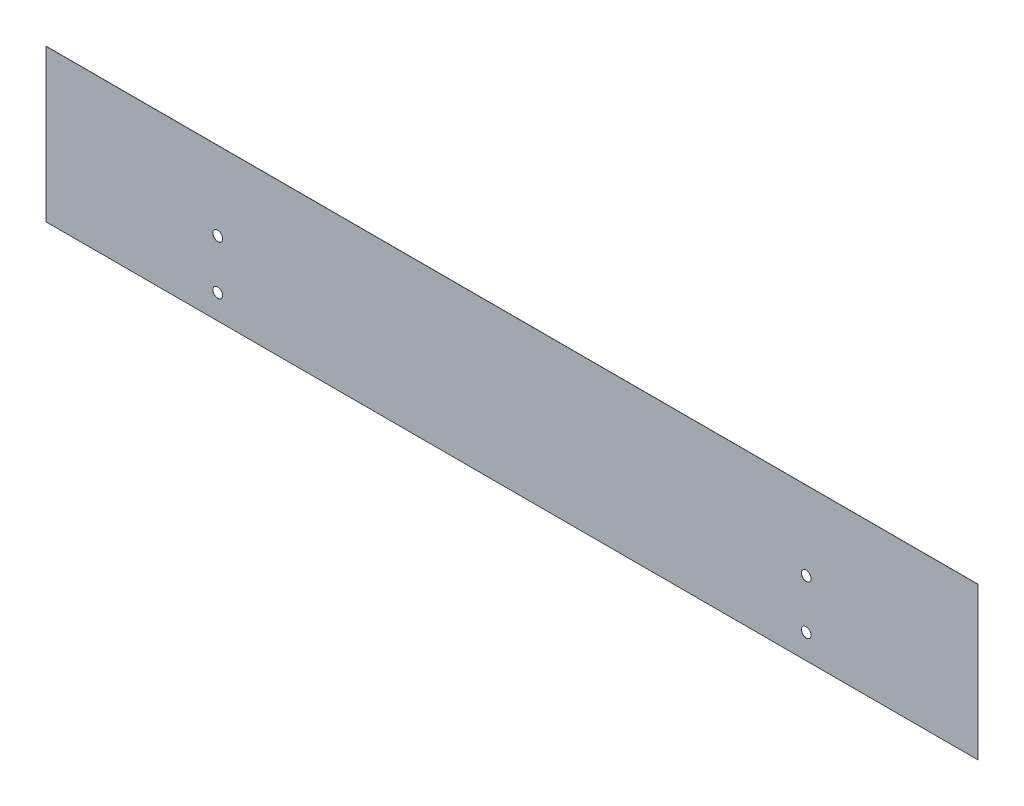
ISO-10303-21;
HEADER;
FILE_DESCRIPTION(('STEP AP214'),'2;1');
FILE_NAME('part.step','',(''),(''),'','','');
FILE_SCHEMA(('AUTOMOTIVE_DESIGN { 1 0 10303 214 1 1 1 1 }'));
ENDSEC;
DATA;
#1=APPLICATION_CONTEXT('core data for automotive mechanical design processes');
#2=APPLICATION_PROTOCOL_DEFINITION('international standard','automotive_design',2000,#1);
#3=PRODUCT_CONTEXT('',#1,'mechanical');
#4=PRODUCT('Part','Part','',(#3));
#5=PRODUCT_RELATED_PRODUCT_CATEGORY('part','',(#4));
#6=PRODUCT_DEFINITION_FORMATION('','',#4);
#7=PRODUCT_DEFINITION_CONTEXT('part definition',#1,'design');
#8=PRODUCT_DEFINITION('design','',#6,#7);
#9=PRODUCT_DEFINITION_SHAPE('','',#8);
#10=(LENGTH_UNIT() NAMED_UNIT(*) SI_UNIT(.MILLI.,.METRE.));
#11=(NAMED_UNIT(*) PLANE_ANGLE_UNIT() SI_UNIT($,.RADIAN.));
#12=(NAMED_UNIT(*) SI_UNIT($,.STERADIAN.) SOLID_ANGLE_UNIT());
#13=UNCERTAINTY_MEASURE_WITH_UNIT(LENGTH_MEASURE(1.E-05),#10,'distance_accuracy_value','');
#14=(GEOMETRIC_REPRESENTATION_CONTEXT(3) GLOBAL_UNCERTAINTY_ASSIGNED_CONTEXT((#13)) GLOBAL_UNIT_ASSIGNED_CONTEXT((#10,
#11,#12)) REPRESENTATION_CONTEXT('',''));
#15=CARTESIAN_POINT('',(0.,0.,0.));
#16=DIRECTION('',(0.,0.,1.));
#17=DIRECTION('',(1.,0.,0.));
#18=AXIS2_PLACEMENT_3D('',#15,#16,#17);
#19=CARTESIAN_POINT('',(190.,-31.,0.0625));
#20=DIRECTION('',(-1.,0.,0.));
#21=DIRECTION('',(0.,0.,1.));
#22=AXIS2_PLACEMENT_3D('',#19,#20,#21);
#23=PLANE('',#22);
#24=DIRECTION('',(0.,1.,0.));
#25=VECTOR('',#24,1.);
#26=CARTESIAN_POINT('',(190.,-31.,0.));
#27=LINE('',#26,#25);
#28=CARTESIAN_POINT('',(190.,-31.,0.));
#29=VERTEX_POINT('',#28);
#30=CARTESIAN_POINT('',(190.,31.,0.));
#31=VERTEX_POINT('',#30);
#32=EDGE_CURVE('E96',#29,#31,#27,.T.);
#33=ORIENTED_EDGE('',*,*,#32,.T.);
#34=DIRECTION('',(0.,0.,-1.));
#35=VECTOR('',#34,1.);
#36=CARTESIAN_POINT('',(190.,31.,0.0625));
#37=LINE('',#36,#35);
#38=CARTESIAN_POINT('',(190.,31.,0.0625));
#39=VERTEX_POINT('',#38);
#40=EDGE_CURVE('E11',#39,#31,#37,.T.);
#41=ORIENTED_EDGE('',*,*,#40,.F.);
#42=DIRECTION('',(0.,1.,0.));
#43=VECTOR('',#42,1.);
#44=CARTESIAN_POINT('',(190.,-31.,0.0625));
#45=LINE('',#44,#43);
#46=CARTESIAN_POINT('',(190.,-31.,0.0625));
#47=VERTEX_POINT('',#46);
#48=EDGE_CURVE('E84',#47,#39,#45,.T.);
#49=ORIENTED_EDGE('',*,*,#48,.F.);
#50=DIRECTION('',(0.,0.,-1.));
#51=VECTOR('',#50,1.);
#52=CARTESIAN_POINT('',(190.,-31.,0.0625));
#53=LINE('',#52,#51);
#54=EDGE_CURVE('E92',#47,#29,#53,.T.);
#55=ORIENTED_EDGE('',*,*,#54,.T.);
#56=EDGE_LOOP('',(#33,#41,#49,#55));
#57=FACE_BOUND('',#56,.T.);
#58=ADVANCED_FACE('F33',(#57),#23,.F.);
#59=CARTESIAN_POINT('',(-190.,31.,0.0625));
#60=DIRECTION('',(0.,-1.,0.));
#61=DIRECTION('',(0.,0.,-1.));
#62=AXIS2_PLACEMENT_3D('',#59,#60,#61);
#63=PLANE('',#62);
#64=DIRECTION('',(-1.,0.,0.));
#65=VECTOR('',#64,1.);
#66=CARTESIAN_POINT('',(-190.,31.,0.));
#67=LINE('',#66,#65);
#68=CARTESIAN_POINT('',(-190.,31.,0.));
#69=VERTEX_POINT('',#68);
#70=EDGE_CURVE('E88',#31,#69,#67,.T.);
#71=ORIENTED_EDGE('',*,*,#70,.T.);
#72=DIRECTION('',(0.,0.,-1.));
#73=VECTOR('',#72,1.);
#74=CARTESIAN_POINT('',(-190.,31.,0.0625));
#75=LINE('',#74,#73);
#76=CARTESIAN_POINT('',(-190.,31.,0.0625));
#77=VERTEX_POINT('',#76);
#78=EDGE_CURVE('E41',#77,#69,#75,.T.);
#79=ORIENTED_EDGE('',*,*,#78,.F.);
#80=DIRECTION('',(-1.,0.,0.));
#81=VECTOR('',#80,1.);
#82=CARTESIAN_POINT('',(-190.,31.,0.0625));
#83=LINE('',#82,#81);
#84=EDGE_CURVE('E79',#39,#77,#83,.T.);
#85=ORIENTED_EDGE('',*,*,#84,.F.);
#86=ORIENTED_EDGE('',*,*,#40,.T.);
#87=EDGE_LOOP('',(#71,#79,#85,#86));
#88=FACE_BOUND('',#87,.T.);
#89=ADVANCED_FACE('F87',(#88),#63,.F.);
#90=CARTESIAN_POINT('',(-190.,-31.,0.0625));
#91=DIRECTION('',(1.,0.,0.));
#92=DIRECTION('',(0.,0.,-1.));
#93=AXIS2_PLACEMENT_3D('',#90,#91,#92);
#94=PLANE('',#93);
#95=DIRECTION('',(0.,-1.,0.));
#96=VECTOR('',#95,1.);
#97=CARTESIAN_POINT('',(-190.,-31.,0.));
#98=LINE('',#97,#96);
#99=CARTESIAN_POINT('',(-190.,-31.,0.));
#100=VERTEX_POINT('',#99);
#101=EDGE_CURVE('E66',#69,#100,#98,.T.);
#102=ORIENTED_EDGE('',*,*,#101,.T.);
#103=DIRECTION('',(0.,0.,-1.));
#104=VECTOR('',#103,1.);
#105=CARTESIAN_POINT('',(-190.,-31.,0.0625));
#106=LINE('',#105,#104);
#107=CARTESIAN_POINT('',(-190.,-31.,0.0625));
#108=VERTEX_POINT('',#107);
#109=EDGE_CURVE('E89',#108,#100,#106,.T.);
#110=ORIENTED_EDGE('',*,*,#109,.F.);
#111=DIRECTION('',(0.,-1.,0.));
#112=VECTOR('',#111,1.);
#113=CARTESIAN_POINT('',(-190.,-31.,0.0625));
#114=LINE('',#113,#112);
#115=EDGE_CURVE('E82',#77,#108,#114,.T.);
#116=ORIENTED_EDGE('',*,*,#115,.F.);
#117=ORIENTED_EDGE('',*,*,#78,.T.);
#118=EDGE_LOOP('',(#102,#110,#116,#117));
#119=FACE_BOUND('',#118,.T.);
#120=ADVANCED_FACE('F90',(#119),#94,.F.);
#121=CARTESIAN_POINT('',(-190.,-31.,0.0625));
#122=DIRECTION('',(0.,1.,0.));
#123=DIRECTION('',(0.,0.,1.));
#124=AXIS2_PLACEMENT_3D('',#121,#122,#123);
#125=PLANE('',#124);
#126=DIRECTION('',(1.,0.,0.));
#127=VECTOR('',#126,1.);
#128=CARTESIAN_POINT('',(-190.,-31.,0.));
#129=LINE('',#128,#127);
#130=EDGE_CURVE('E72',#100,#29,#129,.T.);
#131=ORIENTED_EDGE('',*,*,#130,.T.);
#132=ORIENTED_EDGE('',*,*,#54,.F.);
#133=DIRECTION('',(1.,0.,0.));
#134=VECTOR('',#133,1.);
#135=CARTESIAN_POINT('',(-190.,-31.,0.0625));
#136=LINE('',#135,#134);
#137=EDGE_CURVE('E49',#108,#47,#136,.T.);
#138=ORIENTED_EDGE('',*,*,#137,.F.);
#139=ORIENTED_EDGE('',*,*,#109,.T.);
#140=EDGE_LOOP('',(#131,#132,#138,#139));
#141=FACE_BOUND('',#140,.T.);
#142=ADVANCED_FACE('F104',(#141),#125,.F.);
#143=CARTESIAN_POINT('',(0.,0.,0.0625));
#144=DIRECTION('',(0.,0.,-1.));
#145=DIRECTION('',(-1.,0.,0.));
#146=AXIS2_PLACEMENT_3D('',#143,#144,#145);
#147=PLANE('',#146);
#148=CARTESIAN_POINT('',(-120.,-21.,0.0625));
#149=DIRECTION('',(0.,0.,1.));
#150=DIRECTION('',(1.,0.,0.));
#151=AXIS2_PLACEMENT_3D('',#148,#149,#150);
#152=CIRCLE('',#151,2.);
#153=CARTESIAN_POINT('',(-118.,-21.,0.0625));
#154=VERTEX_POINT('',#153);
#155=EDGE_CURVE('E116',#154,#154,#152,.T.);
#156=ORIENTED_EDGE('',*,*,#155,.F.);
#157=EDGE_LOOP('',(#156));
#158=FACE_BOUND('',#157,.T.);
#159=CARTESIAN_POINT('',(120.,-21.,0.0625));
#160=DIRECTION('',(0.,0.,1.));
#161=DIRECTION('',(1.,0.,0.));
#162=AXIS2_PLACEMENT_3D('',#159,#160,#161);
#163=CIRCLE('',#162,2.);
#164=CARTESIAN_POINT('',(122.,-21.,0.0625));
#165=VERTEX_POINT('',#164);
#166=EDGE_CURVE('E122',#165,#165,#163,.T.);
#167=ORIENTED_EDGE('',*,*,#166,.F.);
#168=EDGE_LOOP('',(#167));
#169=FACE_BOUND('',#168,.T.);
#170=CARTESIAN_POINT('',(120.,-0.999999999999968,0.0625));
#171=DIRECTION('',(0.,0.,1.));
#172=DIRECTION('',(1.,0.,0.));
#173=AXIS2_PLACEMENT_3D('',#170,#171,#172);
#174=CIRCLE('',#173,2.);
#175=CARTESIAN_POINT('',(122.,-0.999999999999968,0.0625));
#176=VERTEX_POINT('',#175);
#177=EDGE_CURVE('E128',#176,#176,#174,.T.);
#178=ORIENTED_EDGE('',*,*,#177,.F.);
#179=EDGE_LOOP('',(#178));
#180=FACE_BOUND('',#179,.T.);
#181=CARTESIAN_POINT('',(-120.,-0.999999999999997,0.0625));
#182=DIRECTION('',(0.,0.,1.));
#183=DIRECTION('',(1.,0.,0.));
#184=AXIS2_PLACEMENT_3D('',#181,#182,#183);
#185=CIRCLE('',#184,2.);
#186=CARTESIAN_POINT('',(-118.,-0.999999999999997,0.0625));
#187=VERTEX_POINT('',#186);
#188=EDGE_CURVE('E110',#187,#187,#185,.T.);
#189=ORIENTED_EDGE('',*,*,#188,.F.);
#190=EDGE_LOOP('',(#189));
#191=FACE_BOUND('',#190,.T.);
#192=ORIENTED_EDGE('',*,*,#48,.T.);
#193=ORIENTED_EDGE('',*,*,#84,.T.);
#194=ORIENTED_EDGE('',*,*,#115,.T.);
#195=ORIENTED_EDGE('',*,*,#137,.T.);
#196=EDGE_LOOP('',(#192,#193,#194,#195));
#197=FACE_BOUND('',#196,.T.);
#198=ADVANCED_FACE('F80',(#158,#169,#180,#191,#197),#147,.F.);
#199=CARTESIAN_POINT('',(0.,0.,0.));
#200=DIRECTION('',(0.,0.,-1.));
#201=DIRECTION('',(-1.,0.,0.));
#202=AXIS2_PLACEMENT_3D('',#199,#200,#201);
#203=PLANE('',#202);
#204=CARTESIAN_POINT('',(-120.,-21.,0.));
#205=DIRECTION('',(0.,0.,1.));
#206=DIRECTION('',(1.,0.,0.));
#207=AXIS2_PLACEMENT_3D('',#204,#205,#206);
#208=CIRCLE('',#207,2.);
#209=CARTESIAN_POINT('',(-118.,-21.,0.));
#210=VERTEX_POINT('',#209);
#211=EDGE_CURVE('E119',#210,#210,#208,.T.);
#212=ORIENTED_EDGE('',*,*,#211,.T.);
#213=EDGE_LOOP('',(#212));
#214=FACE_BOUND('',#213,.T.);
#215=CARTESIAN_POINT('',(120.,-21.,0.));
#216=DIRECTION('',(0.,0.,1.));
#217=DIRECTION('',(1.,0.,0.));
#218=AXIS2_PLACEMENT_3D('',#215,#216,#217);
#219=CIRCLE('',#218,2.);
#220=CARTESIAN_POINT('',(122.,-21.,0.));
#221=VERTEX_POINT('',#220);
#222=EDGE_CURVE('E125',#221,#221,#219,.T.);
#223=ORIENTED_EDGE('',*,*,#222,.T.);
#224=EDGE_LOOP('',(#223));
#225=FACE_BOUND('',#224,.T.);
#226=CARTESIAN_POINT('',(120.,-0.999999999999968,0.));
#227=DIRECTION('',(0.,0.,1.));
#228=DIRECTION('',(1.,0.,0.));
#229=AXIS2_PLACEMENT_3D('',#226,#227,#228);
#230=CIRCLE('',#229,2.);
#231=CARTESIAN_POINT('',(122.,-0.999999999999968,0.));
#232=VERTEX_POINT('',#231);
#233=EDGE_CURVE('E113',#232,#232,#230,.T.);
#234=ORIENTED_EDGE('',*,*,#233,.T.);
#235=EDGE_LOOP('',(#234));
#236=FACE_BOUND('',#235,.T.);
#237=CARTESIAN_POINT('',(-120.,-0.999999999999997,0.));
#238=DIRECTION('',(0.,0.,1.));
#239=DIRECTION('',(1.,0.,0.));
#240=AXIS2_PLACEMENT_3D('',#237,#238,#239);
#241=CIRCLE('',#240,2.);
#242=CARTESIAN_POINT('',(-118.,-0.999999999999997,0.));
#243=VERTEX_POINT('',#242);
#244=EDGE_CURVE('E99',#243,#243,#241,.T.);
#245=ORIENTED_EDGE('',*,*,#244,.T.);
#246=EDGE_LOOP('',(#245));
#247=FACE_BOUND('',#246,.T.);
#248=ORIENTED_EDGE('',*,*,#32,.F.);
#249=ORIENTED_EDGE('',*,*,#130,.F.);
#250=ORIENTED_EDGE('',*,*,#101,.F.);
#251=ORIENTED_EDGE('',*,*,#70,.F.);
#252=EDGE_LOOP('',(#248,#249,#250,#251));
#253=FACE_BOUND('',#252,.T.);
#254=ADVANCED_FACE('F107',(#214,#225,#236,#247,#253),#203,.T.);
#255=CARTESIAN_POINT('',(-120.,-0.999999999999997,0.));
#256=DIRECTION('',(0.,0.,1.));
#257=DIRECTION('',(1.,0.,0.));
#258=AXIS2_PLACEMENT_3D('',#255,#256,#257);
#259=CYLINDRICAL_SURFACE('',#258,2.);
#260=ORIENTED_EDGE('',*,*,#244,.F.);
#261=EDGE_LOOP('',(#260));
#262=FACE_BOUND('',#261,.T.);
#263=ORIENTED_EDGE('',*,*,#188,.T.);
#264=EDGE_LOOP('',(#263));
#265=FACE_BOUND('',#264,.T.);
#266=ADVANCED_FACE('F140',(#262,#265),#259,.F.);
#267=CARTESIAN_POINT('',(120.,-0.999999999999968,0.));
#268=DIRECTION('',(0.,0.,1.));
#269=DIRECTION('',(1.,0.,0.));
#270=AXIS2_PLACEMENT_3D('',#267,#268,#269);
#271=CYLINDRICAL_SURFACE('',#270,2.);
#272=ORIENTED_EDGE('',*,*,#233,.F.);
#273=EDGE_LOOP('',(#272));
#274=FACE_BOUND('',#273,.T.);
#275=ORIENTED_EDGE('',*,*,#177,.T.);
#276=EDGE_LOOP('',(#275));
#277=FACE_BOUND('',#276,.T.);
#278=ADVANCED_FACE('F136',(#274,#277),#271,.F.);
#279=CARTESIAN_POINT('',(120.,-21.,0.));
#280=DIRECTION('',(0.,0.,1.));
#281=DIRECTION('',(1.,0.,0.));
#282=AXIS2_PLACEMENT_3D('',#279,#280,#281);
#283=CYLINDRICAL_SURFACE('',#282,2.);
#284=ORIENTED_EDGE('',*,*,#222,.F.);
#285=EDGE_LOOP('',(#284));
#286=FACE_BOUND('',#285,.T.);
#287=ORIENTED_EDGE('',*,*,#166,.T.);
#288=EDGE_LOOP('',(#287));
#289=FACE_BOUND('',#288,.T.);
#290=ADVANCED_FACE('F139',(#286,#289),#283,.F.);
#291=CARTESIAN_POINT('',(-120.,-21.,0.));
#292=DIRECTION('',(0.,0.,1.));
#293=DIRECTION('',(1.,0.,0.));
#294=AXIS2_PLACEMENT_3D('',#291,#292,#293);
#295=CYLINDRICAL_SURFACE('',#294,2.);
#296=ORIENTED_EDGE('',*,*,#211,.F.);
#297=EDGE_LOOP('',(#296));
#298=FACE_BOUND('',#297,.T.);
#299=ORIENTED_EDGE('',*,*,#155,.T.);
#300=EDGE_LOOP('',(#299));
#301=FACE_BOUND('',#300,.T.);
#302=ADVANCED_FACE('F201',(#298,#301),#295,.F.);
#303=CLOSED_SHELL('',(#58,#89,#120,#142,#198,#254,#266,#278,#290,#302));
#304=MANIFOLD_SOLID_BREP('B2',#303);
#305=ADVANCED_BREP_SHAPE_REPRESENTATION('',(#18,#304),#14);
#306=SHAPE_DEFINITION_REPRESENTATION(#9,#305);
ENDSEC;
END-ISO-10303-21;
